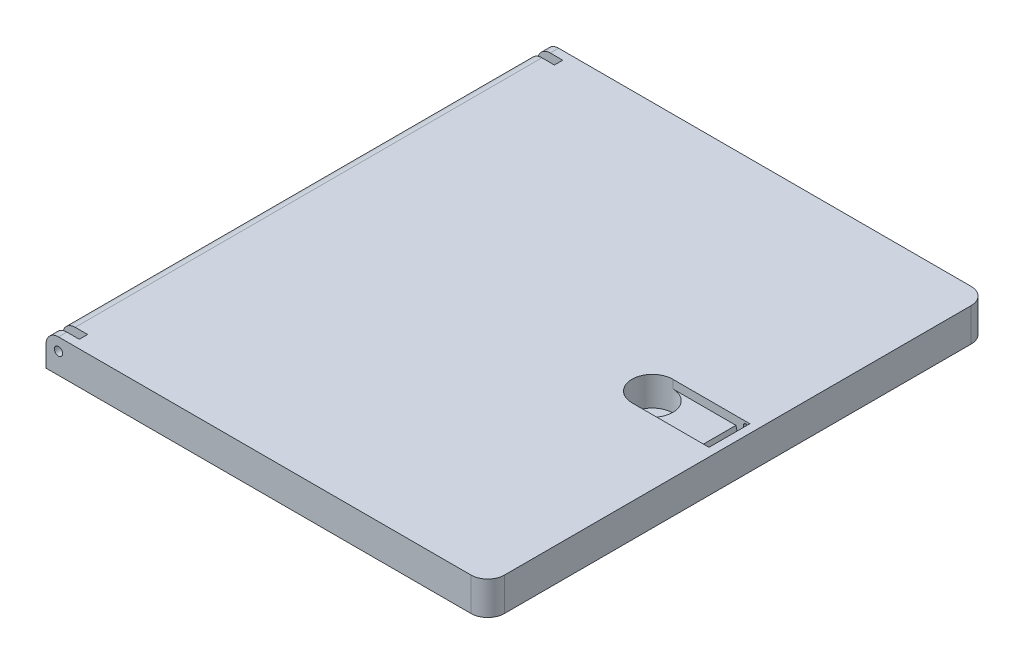
ISO-10303-21;
HEADER;
FILE_DESCRIPTION(('STEP AP214'),'2;1');
FILE_NAME('part.step','',(''),(''),'','','');
FILE_SCHEMA(('AUTOMOTIVE_DESIGN { 1 0 10303 214 1 1 1 1 }'));
ENDSEC;
DATA;
#1=APPLICATION_CONTEXT('core data for automotive mechanical design processes');
#2=APPLICATION_PROTOCOL_DEFINITION('international standard','automotive_design',2000,#1);
#3=PRODUCT_CONTEXT('',#1,'mechanical');
#4=PRODUCT('Part','Part','',(#3));
#5=PRODUCT_RELATED_PRODUCT_CATEGORY('part','',(#4));
#6=PRODUCT_DEFINITION_FORMATION('','',#4);
#7=PRODUCT_DEFINITION_CONTEXT('part definition',#1,'design');
#8=PRODUCT_DEFINITION('design','',#6,#7);
#9=PRODUCT_DEFINITION_SHAPE('','',#8);
#10=(LENGTH_UNIT() NAMED_UNIT(*) SI_UNIT(.MILLI.,.METRE.));
#11=(NAMED_UNIT(*) PLANE_ANGLE_UNIT() SI_UNIT($,.RADIAN.));
#12=(NAMED_UNIT(*) SI_UNIT($,.STERADIAN.) SOLID_ANGLE_UNIT());
#13=UNCERTAINTY_MEASURE_WITH_UNIT(LENGTH_MEASURE(1.E-05),#10,'distance_accuracy_value','');
#14=(GEOMETRIC_REPRESENTATION_CONTEXT(3) GLOBAL_UNCERTAINTY_ASSIGNED_CONTEXT((#13)) GLOBAL_UNIT_ASSIGNED_CONTEXT((#10,
#11,#12)) REPRESENTATION_CONTEXT('',''));
#15=CARTESIAN_POINT('',(0.,0.,0.));
#16=DIRECTION('',(0.,0.,1.));
#17=DIRECTION('',(1.,0.,0.));
#18=AXIS2_PLACEMENT_3D('',#15,#16,#17);
#19=CARTESIAN_POINT('',(-106.,-8.,0.));
#20=DIRECTION('',(-1.,0.,0.));
#21=DIRECTION('',(0.,0.,1.));
#22=AXIS2_PLACEMENT_3D('',#19,#20,#21);
#23=PLANE('',#22);
#24=DIRECTION('',(0.,1.,0.));
#25=VECTOR('',#24,1.);
#26=CARTESIAN_POINT('',(-106.,-8.,60.));
#27=LINE('',#26,#25);
#28=CARTESIAN_POINT('',(-106.,-8.,60.));
#29=VERTEX_POINT('',#28);
#30=CARTESIAN_POINT('',(-106.,-3.,60.));
#31=VERTEX_POINT('',#30);
#32=EDGE_CURVE('E267',#29,#31,#27,.T.);
#33=ORIENTED_EDGE('',*,*,#32,.T.);
#34=DIRECTION('',(0.,0.,1.));
#35=VECTOR('',#34,1.);
#36=CARTESIAN_POINT('',(-106.,-3.,-60.));
#37=LINE('',#36,#35);
#38=CARTESIAN_POINT('',(-106.,-3.,58.));
#39=VERTEX_POINT('',#38);
#40=EDGE_CURVE('E241',#39,#31,#37,.T.);
#41=ORIENTED_EDGE('',*,*,#40,.F.);
#42=DIRECTION('',(0.,1.,0.));
#43=VECTOR('',#42,1.);
#44=CARTESIAN_POINT('',(-106.,-6.,58.));
#45=LINE('',#44,#43);
#46=CARTESIAN_POINT('',(-106.,-6.,58.));
#47=VERTEX_POINT('',#46);
#48=EDGE_CURVE('E331',#47,#39,#45,.T.);
#49=ORIENTED_EDGE('',*,*,#48,.F.);
#50=DIRECTION('',(0.,0.,1.));
#51=VECTOR('',#50,1.);
#52=CARTESIAN_POINT('',(-106.,-6.,58.));
#53=LINE('',#52,#51);
#54=CARTESIAN_POINT('',(-106.,-6.,56.));
#55=VERTEX_POINT('',#54);
#56=EDGE_CURVE('E318',#55,#47,#53,.T.);
#57=ORIENTED_EDGE('',*,*,#56,.F.);
#58=DIRECTION('',(0.,1.,0.));
#59=VECTOR('',#58,1.);
#60=CARTESIAN_POINT('',(-106.,-6.,56.));
#61=LINE('',#60,#59);
#62=CARTESIAN_POINT('',(-106.,-3.,56.));
#63=VERTEX_POINT('',#62);
#64=EDGE_CURVE('E338',#55,#63,#61,.T.);
#65=ORIENTED_EDGE('',*,*,#64,.T.);
#66=CARTESIAN_POINT('',(-106.,-3.,-56.));
#67=VERTEX_POINT('',#66);
#68=EDGE_CURVE('E490',#67,#63,#37,.T.);
#69=ORIENTED_EDGE('',*,*,#68,.F.);
#70=DIRECTION('',(0.,1.,0.));
#71=VECTOR('',#70,1.);
#72=CARTESIAN_POINT('',(-106.,-6.,-56.));
#73=LINE('',#72,#71);
#74=CARTESIAN_POINT('',(-106.,-6.,-56.));
#75=VERTEX_POINT('',#74);
#76=EDGE_CURVE('E530',#75,#67,#73,.T.);
#77=ORIENTED_EDGE('',*,*,#76,.F.);
#78=DIRECTION('',(0.,0.,-1.));
#79=VECTOR('',#78,1.);
#80=CARTESIAN_POINT('',(-106.,-6.,-58.));
#81=LINE('',#80,#79);
#82=CARTESIAN_POINT('',(-106.,-6.,-58.));
#83=VERTEX_POINT('',#82);
#84=EDGE_CURVE('E522',#75,#83,#81,.T.);
#85=ORIENTED_EDGE('',*,*,#84,.T.);
#86=DIRECTION('',(0.,1.,0.));
#87=VECTOR('',#86,1.);
#88=CARTESIAN_POINT('',(-106.,-6.,-58.));
#89=LINE('',#88,#87);
#90=CARTESIAN_POINT('',(-106.,-3.,-58.));
#91=VERTEX_POINT('',#90);
#92=EDGE_CURVE('E302',#83,#91,#89,.T.);
#93=ORIENTED_EDGE('',*,*,#92,.T.);
#94=CARTESIAN_POINT('',(-106.,-3.,-60.));
#95=VERTEX_POINT('',#94);
#96=EDGE_CURVE('E56',#95,#91,#37,.T.);
#97=ORIENTED_EDGE('',*,*,#96,.F.);
#98=DIRECTION('',(0.,1.,0.));
#99=VECTOR('',#98,1.);
#100=CARTESIAN_POINT('',(-106.,-8.,-60.));
#101=LINE('',#100,#99);
#102=CARTESIAN_POINT('',(-106.,-8.,-60.));
#103=VERTEX_POINT('',#102);
#104=EDGE_CURVE('E252',#103,#95,#101,.T.);
#105=ORIENTED_EDGE('',*,*,#104,.F.);
#106=DIRECTION('',(0.,0.,1.));
#107=VECTOR('',#106,1.);
#108=CARTESIAN_POINT('',(-106.,-8.,0.));
#109=LINE('',#108,#107);
#110=EDGE_CURVE('E458',#103,#29,#109,.T.);
#111=ORIENTED_EDGE('',*,*,#110,.T.);
#112=EDGE_LOOP('',(#33,#41,#49,#57,#65,#69,#77,#85,#93,#97,#105,#111));
#113=FACE_BOUND('',#112,.T.);
#114=ADVANCED_FACE('F33',(#113),#23,.T.);
#115=CARTESIAN_POINT('',(0.,0.,0.));
#116=DIRECTION('',(0.,-1.,0.));
#117=DIRECTION('',(0.,0.,-1.));
#118=AXIS2_PLACEMENT_3D('',#115,#116,#117);
#119=PLANE('',#118);
#120=DIRECTION('',(0.,0.,-1.));
#121=VECTOR('',#120,1.);
#122=CARTESIAN_POINT('',(-2.,0.,0.));
#123=LINE('',#122,#121);
#124=CARTESIAN_POINT('',(-2.,0.,4.9));
#125=VERTEX_POINT('',#124);
#126=CARTESIAN_POINT('',(-2.,0.,-4.9));
#127=VERTEX_POINT('',#126);
#128=EDGE_CURVE('E428',#125,#127,#123,.T.);
#129=ORIENTED_EDGE('',*,*,#128,.F.);
#130=DIRECTION('',(1.,0.,0.));
#131=VECTOR('',#130,1.);
#132=CARTESIAN_POINT('',(-2.,0.,4.9));
#133=LINE('',#132,#131);
#134=CARTESIAN_POINT('',(-20.5,0.,4.9));
#135=VERTEX_POINT('',#134);
#136=EDGE_CURVE('E434',#135,#125,#133,.T.);
#137=ORIENTED_EDGE('',*,*,#136,.F.);
#138=CARTESIAN_POINT('',(-20.5,0.,0.));
#139=DIRECTION('',(0.,1.,0.));
#140=DIRECTION('',(0.,0.,1.));
#141=AXIS2_PLACEMENT_3D('',#138,#139,#140);
#142=CIRCLE('',#141,4.9);
#143=CARTESIAN_POINT('',(-20.5,0.,-4.9));
#144=VERTEX_POINT('',#143);
#145=EDGE_CURVE('E443',#144,#135,#142,.T.);
#146=ORIENTED_EDGE('',*,*,#145,.F.);
#147=DIRECTION('',(-1.,0.,0.));
#148=VECTOR('',#147,1.);
#149=CARTESIAN_POINT('',(-2.,0.,-4.9));
#150=LINE('',#149,#148);
#151=EDGE_CURVE('E440',#127,#144,#150,.T.);
#152=ORIENTED_EDGE('',*,*,#151,.F.);
#153=EDGE_LOOP('',(#129,#137,#146,#152));
#154=FACE_BOUND('',#153,.T.);
#155=DIRECTION('',(0.,0.,1.));
#156=VECTOR('',#155,1.);
#157=CARTESIAN_POINT('',(-103.,0.,-60.));
#158=LINE('',#157,#156);
#159=CARTESIAN_POINT('',(-103.,0.,58.));
#160=VERTEX_POINT('',#159);
#161=CARTESIAN_POINT('',(-103.,0.,60.));
#162=VERTEX_POINT('',#161);
#163=EDGE_CURVE('E48',#160,#162,#158,.T.);
#164=ORIENTED_EDGE('',*,*,#163,.T.);
#165=DIRECTION('',(1.,0.,0.));
#166=VECTOR('',#165,1.);
#167=CARTESIAN_POINT('',(0.,0.,60.));
#168=LINE('',#167,#166);
#169=CARTESIAN_POINT('',(-4.,0.,60.));
#170=VERTEX_POINT('',#169);
#171=EDGE_CURVE('E258',#162,#170,#168,.T.);
#172=ORIENTED_EDGE('',*,*,#171,.T.);
#173=CARTESIAN_POINT('',(-4.,0.,56.));
#174=DIRECTION('',(0.,-1.,0.));
#175=DIRECTION('',(0.,0.,-1.));
#176=AXIS2_PLACEMENT_3D('',#173,#174,#175);
#177=CIRCLE('',#176,4.);
#178=CARTESIAN_POINT('',(0.,0.,56.));
#179=VERTEX_POINT('',#178);
#180=EDGE_CURVE('E276',#170,#179,#177,.F.);
#181=ORIENTED_EDGE('',*,*,#180,.T.);
#182=DIRECTION('',(0.,0.,-1.));
#183=VECTOR('',#182,1.);
#184=CARTESIAN_POINT('',(0.,0.,0.));
#185=LINE('',#184,#183);
#186=CARTESIAN_POINT('',(0.,0.,-56.));
#187=VERTEX_POINT('',#186);
#188=EDGE_CURVE('E259',#179,#187,#185,.T.);
#189=ORIENTED_EDGE('',*,*,#188,.T.);
#190=CARTESIAN_POINT('',(-4.,0.,-56.));
#191=DIRECTION('',(0.,-1.,0.));
#192=DIRECTION('',(0.,0.,-1.));
#193=AXIS2_PLACEMENT_3D('',#190,#191,#192);
#194=CIRCLE('',#193,4.);
#195=CARTESIAN_POINT('',(-4.,0.,-60.));
#196=VERTEX_POINT('',#195);
#197=EDGE_CURVE('E257',#187,#196,#194,.F.);
#198=ORIENTED_EDGE('',*,*,#197,.T.);
#199=DIRECTION('',(-1.,0.,0.));
#200=VECTOR('',#199,1.);
#201=CARTESIAN_POINT('',(0.,0.,-60.));
#202=LINE('',#201,#200);
#203=CARTESIAN_POINT('',(-103.,0.,-60.));
#204=VERTEX_POINT('',#203);
#205=EDGE_CURVE('E249',#196,#204,#202,.T.);
#206=ORIENTED_EDGE('',*,*,#205,.T.);
#207=CARTESIAN_POINT('',(-103.,0.,-58.));
#208=VERTEX_POINT('',#207);
#209=EDGE_CURVE('E233',#204,#208,#158,.T.);
#210=ORIENTED_EDGE('',*,*,#209,.T.);
#211=DIRECTION('',(1.,0.,0.));
#212=VECTOR('',#211,1.);
#213=CARTESIAN_POINT('',(-106.,0.,-58.));
#214=LINE('',#213,#212);
#215=CARTESIAN_POINT('',(-100.,0.,-58.));
#216=VERTEX_POINT('',#215);
#217=EDGE_CURVE('E525',#208,#216,#214,.T.);
#218=ORIENTED_EDGE('',*,*,#217,.T.);
#219=DIRECTION('',(0.,0.,1.));
#220=VECTOR('',#219,1.);
#221=CARTESIAN_POINT('',(-100.,0.,-58.));
#222=LINE('',#221,#220);
#223=CARTESIAN_POINT('',(-100.,0.,-56.));
#224=VERTEX_POINT('',#223);
#225=EDGE_CURVE('E518',#216,#224,#222,.T.);
#226=ORIENTED_EDGE('',*,*,#225,.T.);
#227=DIRECTION('',(-1.,0.,0.));
#228=VECTOR('',#227,1.);
#229=CARTESIAN_POINT('',(-106.,0.,-56.));
#230=LINE('',#229,#228);
#231=CARTESIAN_POINT('',(-103.,0.,-56.));
#232=VERTEX_POINT('',#231);
#233=EDGE_CURVE('E515',#224,#232,#230,.T.);
#234=ORIENTED_EDGE('',*,*,#233,.T.);
#235=CARTESIAN_POINT('',(-103.,0.,56.));
#236=VERTEX_POINT('',#235);
#237=EDGE_CURVE('E242',#232,#236,#158,.T.);
#238=ORIENTED_EDGE('',*,*,#237,.T.);
#239=DIRECTION('',(-1.,0.,0.));
#240=VECTOR('',#239,1.);
#241=CARTESIAN_POINT('',(-106.,0.,56.));
#242=LINE('',#241,#240);
#243=CARTESIAN_POINT('',(-100.,0.,56.));
#244=VERTEX_POINT('',#243);
#245=EDGE_CURVE('E322',#244,#236,#242,.T.);
#246=ORIENTED_EDGE('',*,*,#245,.F.);
#247=DIRECTION('',(0.,0.,-1.));
#248=VECTOR('',#247,1.);
#249=CARTESIAN_POINT('',(-100.,0.,58.));
#250=LINE('',#249,#248);
#251=CARTESIAN_POINT('',(-100.,0.,58.));
#252=VERTEX_POINT('',#251);
#253=EDGE_CURVE('E333',#252,#244,#250,.T.);
#254=ORIENTED_EDGE('',*,*,#253,.F.);
#255=DIRECTION('',(1.,0.,0.));
#256=VECTOR('',#255,1.);
#257=CARTESIAN_POINT('',(-106.,0.,58.));
#258=LINE('',#257,#256);
#259=EDGE_CURVE('E317',#160,#252,#258,.T.);
#260=ORIENTED_EDGE('',*,*,#259,.F.);
#261=EDGE_LOOP('',(#164,#172,#181,#189,#198,#206,#210,#218,#226,#234,#238,#246,#254,#260));
#262=FACE_BOUND('',#261,.T.);
#263=ADVANCED_FACE('F255',(#154,#262),#119,.F.);
#264=CARTESIAN_POINT('',(-103.,-3.,-60.));
#265=DIRECTION('',(0.,0.,1.));
#266=DIRECTION('',(1.,0.,0.));
#267=AXIS2_PLACEMENT_3D('',#264,#265,#266);
#268=CYLINDRICAL_SURFACE('',#267,0.999999999999998);
#269=CARTESIAN_POINT('',(-103.,-3.,-60.));
#270=DIRECTION('',(0.,0.,1.));
#271=DIRECTION('',(1.,0.,0.));
#272=AXIS2_PLACEMENT_3D('',#269,#270,#271);
#273=CIRCLE('',#272,0.999999999999998);
#274=CARTESIAN_POINT('',(-102.,-3.,-60.));
#275=VERTEX_POINT('',#274);
#276=EDGE_CURVE('E298',#275,#275,#273,.T.);
#277=ORIENTED_EDGE('',*,*,#276,.F.);
#278=EDGE_LOOP('',(#277));
#279=FACE_BOUND('',#278,.T.);
#280=CARTESIAN_POINT('',(-103.,-3.,-58.));
#281=DIRECTION('',(0.,0.,1.));
#282=DIRECTION('',(1.,0.,0.));
#283=AXIS2_PLACEMENT_3D('',#280,#281,#282);
#284=CIRCLE('',#283,0.999999999999998);
#285=CARTESIAN_POINT('',(-102.,-3.,-58.));
#286=VERTEX_POINT('',#285);
#287=EDGE_CURVE('E301',#286,#286,#284,.F.);
#288=ORIENTED_EDGE('',*,*,#287,.F.);
#289=EDGE_LOOP('',(#288));
#290=FACE_BOUND('',#289,.T.);
#291=ADVANCED_FACE('F572',(#279,#290),#268,.F.);
#292=CARTESIAN_POINT('',(-103.,-3.,56.));
#293=DIRECTION('',(0.,0.,-1.));
#294=DIRECTION('',(-1.,0.,0.));
#295=AXIS2_PLACEMENT_3D('',#292,#293,#294);
#296=CIRCLE('',#295,0.999999999999998);
#297=CARTESIAN_POINT('',(-104.,-3.,56.));
#298=VERTEX_POINT('',#297);
#299=EDGE_CURVE('E297',#298,#298,#296,.T.);
#300=ORIENTED_EDGE('',*,*,#299,.F.);
#301=EDGE_LOOP('',(#300));
#302=FACE_BOUND('',#301,.T.);
#303=CARTESIAN_POINT('',(-103.,-3.,-56.));
#304=DIRECTION('',(0.,0.,-1.));
#305=DIRECTION('',(-1.,0.,0.));
#306=AXIS2_PLACEMENT_3D('',#303,#304,#305);
#307=CIRCLE('',#306,0.999999999999998);
#308=CARTESIAN_POINT('',(-104.,-3.,-56.));
#309=VERTEX_POINT('',#308);
#310=EDGE_CURVE('E299',#309,#309,#307,.F.);
#311=ORIENTED_EDGE('',*,*,#310,.F.);
#312=EDGE_LOOP('',(#311));
#313=FACE_BOUND('',#312,.T.);
#314=ADVANCED_FACE('F816',(#302,#313),#268,.F.);
#315=CARTESIAN_POINT('',(0.,-8.,60.));
#316=DIRECTION('',(0.,0.,1.));
#317=DIRECTION('',(1.,0.,0.));
#318=AXIS2_PLACEMENT_3D('',#315,#316,#317);
#319=PLANE('',#318);
#320=CARTESIAN_POINT('',(-103.,-3.,60.));
#321=DIRECTION('',(0.,0.,-1.));
#322=DIRECTION('',(1.,0.,0.));
#323=AXIS2_PLACEMENT_3D('',#320,#321,#322);
#324=CIRCLE('',#323,2.99999999999999);
#325=EDGE_CURVE('E253',#31,#162,#324,.T.);
#326=ORIENTED_EDGE('',*,*,#325,.F.);
#327=ORIENTED_EDGE('',*,*,#32,.F.);
#328=DIRECTION('',(1.,0.,0.));
#329=VECTOR('',#328,1.);
#330=CARTESIAN_POINT('',(0.,-8.,60.));
#331=LINE('',#330,#329);
#332=CARTESIAN_POINT('',(-4.,-8.,60.));
#333=VERTEX_POINT('',#332);
#334=EDGE_CURVE('E272',#29,#333,#331,.T.);
#335=ORIENTED_EDGE('',*,*,#334,.T.);
#336=DIRECTION('',(0.,1.,0.));
#337=VECTOR('',#336,1.);
#338=CARTESIAN_POINT('',(-4.,-8.,60.));
#339=LINE('',#338,#337);
#340=EDGE_CURVE('E270',#333,#170,#339,.T.);
#341=ORIENTED_EDGE('',*,*,#340,.T.);
#342=ORIENTED_EDGE('',*,*,#171,.F.);
#343=EDGE_LOOP('',(#326,#327,#335,#341,#342));
#344=FACE_BOUND('',#343,.T.);
#345=CARTESIAN_POINT('',(-103.,-3.,60.));
#346=DIRECTION('',(0.,0.,1.));
#347=DIRECTION('',(1.,0.,0.));
#348=AXIS2_PLACEMENT_3D('',#345,#346,#347);
#349=CIRCLE('',#348,0.999999999999998);
#350=CARTESIAN_POINT('',(-102.,-3.,60.));
#351=VERTEX_POINT('',#350);
#352=EDGE_CURVE('E304',#351,#351,#349,.T.);
#353=ORIENTED_EDGE('',*,*,#352,.F.);
#354=EDGE_LOOP('',(#353));
#355=FACE_BOUND('',#354,.T.);
#356=ADVANCED_FACE('F465',(#344,#355),#319,.T.);
#357=CARTESIAN_POINT('',(0.,-8.,-60.));
#358=DIRECTION('',(0.,0.,-1.));
#359=DIRECTION('',(-1.,0.,0.));
#360=AXIS2_PLACEMENT_3D('',#357,#358,#359);
#361=PLANE('',#360);
#362=CARTESIAN_POINT('',(-103.,-3.,-60.));
#363=DIRECTION('',(0.,0.,-1.));
#364=DIRECTION('',(1.,0.,0.));
#365=AXIS2_PLACEMENT_3D('',#362,#363,#364);
#366=CIRCLE('',#365,2.99999999999999);
#367=EDGE_CURVE('E236',#95,#204,#366,.T.);
#368=ORIENTED_EDGE('',*,*,#367,.T.);
#369=ORIENTED_EDGE('',*,*,#205,.F.);
#370=DIRECTION('',(0.,1.,0.));
#371=VECTOR('',#370,1.);
#372=CARTESIAN_POINT('',(-4.,-8.,-60.));
#373=LINE('',#372,#371);
#374=CARTESIAN_POINT('',(-4.,-8.,-60.));
#375=VERTEX_POINT('',#374);
#376=EDGE_CURVE('E287',#196,#375,#373,.F.);
#377=ORIENTED_EDGE('',*,*,#376,.T.);
#378=DIRECTION('',(-1.,0.,0.));
#379=VECTOR('',#378,1.);
#380=CARTESIAN_POINT('',(0.,-8.,-60.));
#381=LINE('',#380,#379);
#382=EDGE_CURVE('E456',#375,#103,#381,.T.);
#383=ORIENTED_EDGE('',*,*,#382,.T.);
#384=ORIENTED_EDGE('',*,*,#104,.T.);
#385=EDGE_LOOP('',(#368,#369,#377,#383,#384));
#386=FACE_BOUND('',#385,.T.);
#387=ORIENTED_EDGE('',*,*,#276,.T.);
#388=EDGE_LOOP('',(#387));
#389=FACE_BOUND('',#388,.T.);
#390=ADVANCED_FACE('F247',(#386,#389),#361,.T.);
#391=CARTESIAN_POINT('',(0.,-8.,0.));
#392=DIRECTION('',(1.,0.,0.));
#393=DIRECTION('',(0.,0.,-1.));
#394=AXIS2_PLACEMENT_3D('',#391,#392,#393);
#395=PLANE('',#394);
#396=ORIENTED_EDGE('',*,*,#188,.F.);
#397=DIRECTION('',(0.,1.,0.));
#398=VECTOR('',#397,1.);
#399=CARTESIAN_POINT('',(0.,-8.,56.));
#400=LINE('',#399,#398);
#401=CARTESIAN_POINT('',(0.,-8.,56.));
#402=VERTEX_POINT('',#401);
#403=EDGE_CURVE('E281',#179,#402,#400,.F.);
#404=ORIENTED_EDGE('',*,*,#403,.T.);
#405=DIRECTION('',(0.,0.,-1.));
#406=VECTOR('',#405,1.);
#407=CARTESIAN_POINT('',(0.,-8.,0.));
#408=LINE('',#407,#406);
#409=CARTESIAN_POINT('',(0.,-8.,-56.));
#410=VERTEX_POINT('',#409);
#411=EDGE_CURVE('E261',#402,#410,#408,.T.);
#412=ORIENTED_EDGE('',*,*,#411,.T.);
#413=DIRECTION('',(0.,1.,0.));
#414=VECTOR('',#413,1.);
#415=CARTESIAN_POINT('',(0.,-8.,-56.));
#416=LINE('',#415,#414);
#417=EDGE_CURVE('E278',#410,#187,#416,.T.);
#418=ORIENTED_EDGE('',*,*,#417,.T.);
#419=EDGE_LOOP('',(#396,#404,#412,#418));
#420=FACE_BOUND('',#419,.T.);
#421=ADVANCED_FACE('F477',(#420),#395,.T.);
#422=CARTESIAN_POINT('',(0.,-8.,0.));
#423=DIRECTION('',(0.,-1.,0.));
#424=DIRECTION('',(0.,0.,-1.));
#425=AXIS2_PLACEMENT_3D('',#422,#423,#424);
#426=PLANE('',#425);
#427=ORIENTED_EDGE('',*,*,#411,.F.);
#428=CARTESIAN_POINT('',(-4.,-8.,56.));
#429=DIRECTION('',(0.,-1.,0.));
#430=DIRECTION('',(0.,0.,-1.));
#431=AXIS2_PLACEMENT_3D('',#428,#429,#430);
#432=CIRCLE('',#431,4.);
#433=EDGE_CURVE('E285',#402,#333,#432,.T.);
#434=ORIENTED_EDGE('',*,*,#433,.T.);
#435=ORIENTED_EDGE('',*,*,#334,.F.);
#436=ORIENTED_EDGE('',*,*,#110,.F.);
#437=ORIENTED_EDGE('',*,*,#382,.F.);
#438=CARTESIAN_POINT('',(-4.,-8.,-56.));
#439=DIRECTION('',(0.,-1.,0.));
#440=DIRECTION('',(0.,0.,-1.));
#441=AXIS2_PLACEMENT_3D('',#438,#439,#440);
#442=CIRCLE('',#441,4.);
#443=EDGE_CURVE('E283',#375,#410,#442,.T.);
#444=ORIENTED_EDGE('',*,*,#443,.T.);
#445=EDGE_LOOP('',(#427,#434,#435,#436,#437,#444));
#446=FACE_BOUND('',#445,.T.);
#447=ADVANCED_FACE('F484',(#446),#426,.T.);
#448=CARTESIAN_POINT('',(-4.,-8.,56.));
#449=DIRECTION('',(0.,1.,0.));
#450=DIRECTION('',(0.,0.,1.));
#451=AXIS2_PLACEMENT_3D('',#448,#449,#450);
#452=CYLINDRICAL_SURFACE('',#451,4.);
#453=ORIENTED_EDGE('',*,*,#433,.F.);
#454=ORIENTED_EDGE('',*,*,#403,.F.);
#455=ORIENTED_EDGE('',*,*,#180,.F.);
#456=ORIENTED_EDGE('',*,*,#340,.F.);
#457=EDGE_LOOP('',(#453,#454,#455,#456));
#458=FACE_BOUND('',#457,.T.);
#459=ADVANCED_FACE('F473',(#458),#452,.T.);
#460=CARTESIAN_POINT('',(-4.,-8.,-56.));
#461=DIRECTION('',(0.,1.,0.));
#462=DIRECTION('',(0.,0.,1.));
#463=AXIS2_PLACEMENT_3D('',#460,#461,#462);
#464=CYLINDRICAL_SURFACE('',#463,4.);
#465=ORIENTED_EDGE('',*,*,#443,.F.);
#466=ORIENTED_EDGE('',*,*,#376,.F.);
#467=ORIENTED_EDGE('',*,*,#197,.F.);
#468=ORIENTED_EDGE('',*,*,#417,.F.);
#469=EDGE_LOOP('',(#465,#466,#467,#468));
#470=FACE_BOUND('',#469,.T.);
#471=ADVANCED_FACE('F482',(#470),#464,.T.);
#472=CARTESIAN_POINT('',(-2.,-2.,4.9));
#473=DIRECTION('',(0.,0.,1.));
#474=DIRECTION('',(1.,0.,0.));
#475=AXIS2_PLACEMENT_3D('',#472,#473,#474);
#476=PLANE('',#475);
#477=DIRECTION('',(0.,-1.,0.));
#478=VECTOR('',#477,1.);
#479=CARTESIAN_POINT('',(-2.5,-1.,4.9));
#480=LINE('',#479,#478);
#481=CARTESIAN_POINT('',(-2.5,-1.,4.9));
#482=VERTEX_POINT('',#481);
#483=CARTESIAN_POINT('',(-2.5,-6.,4.9));
#484=VERTEX_POINT('',#483);
#485=EDGE_CURVE('E364',#482,#484,#480,.T.);
#486=ORIENTED_EDGE('',*,*,#485,.F.);
#487=CARTESIAN_POINT('',(-3.,-1.,4.9));
#488=DIRECTION('',(0.,0.,-1.));
#489=DIRECTION('',(-1.,0.,0.));
#490=AXIS2_PLACEMENT_3D('',#487,#488,#489);
#491=CIRCLE('',#490,0.5);
#492=CARTESIAN_POINT('',(-3.5,-1.,4.9));
#493=VERTEX_POINT('',#492);
#494=EDGE_CURVE('E341',#493,#482,#491,.T.);
#495=ORIENTED_EDGE('',*,*,#494,.F.);
#496=DIRECTION('',(0.,1.,0.));
#497=VECTOR('',#496,1.);
#498=CARTESIAN_POINT('',(-3.5,-1.,4.9));
#499=LINE('',#498,#497);
#500=CARTESIAN_POINT('',(-3.5,-6.,4.9));
#501=VERTEX_POINT('',#500);
#502=EDGE_CURVE('E353',#501,#493,#499,.T.);
#503=ORIENTED_EDGE('',*,*,#502,.F.);
#504=CARTESIAN_POINT('',(-3.,-6.,4.9));
#505=DIRECTION('',(0.,0.,-1.));
#506=DIRECTION('',(-1.,0.,0.));
#507=AXIS2_PLACEMENT_3D('',#504,#505,#506);
#508=CIRCLE('',#507,0.5);
#509=EDGE_CURVE('E367',#484,#501,#508,.T.);
#510=ORIENTED_EDGE('',*,*,#509,.F.);
#511=EDGE_LOOP('',(#486,#495,#503,#510));
#512=FACE_BOUND('',#511,.T.);
#513=ORIENTED_EDGE('',*,*,#136,.T.);
#514=DIRECTION('',(0.,1.,0.));
#515=VECTOR('',#514,1.);
#516=CARTESIAN_POINT('',(-2.,-2.,4.9));
#517=LINE('',#516,#515);
#518=CARTESIAN_POINT('',(-2.,-7.,4.9));
#519=VERTEX_POINT('',#518);
#520=EDGE_CURVE('E263',#519,#125,#517,.T.);
#521=ORIENTED_EDGE('',*,*,#520,.F.);
#522=DIRECTION('',(1.,0.,0.));
#523=VECTOR('',#522,1.);
#524=CARTESIAN_POINT('',(-2.,-7.,4.9));
#525=LINE('',#524,#523);
#526=CARTESIAN_POINT('',(-4.,-7.,4.9));
#527=VERTEX_POINT('',#526);
#528=EDGE_CURVE('E421',#527,#519,#525,.T.);
#529=ORIENTED_EDGE('',*,*,#528,.F.);
#530=DIRECTION('',(-0.258819045102518,0.965925826289069,0.));
#531=VECTOR('',#530,1.);
#532=CARTESIAN_POINT('',(-5.11602540378444,-2.83493649053889,4.9));
#533=LINE('',#532,#531);
#534=CARTESIAN_POINT('',(-5.33974596215561,-2.,4.9));
#535=VERTEX_POINT('',#534);
#536=EDGE_CURVE('E291',#527,#535,#533,.T.);
#537=ORIENTED_EDGE('',*,*,#536,.T.);
#538=DIRECTION('',(1.,0.,0.));
#539=VECTOR('',#538,1.);
#540=CARTESIAN_POINT('',(-2.,-2.,4.9));
#541=LINE('',#540,#539);
#542=CARTESIAN_POINT('',(-20.5,-2.,4.9));
#543=VERTEX_POINT('',#542);
#544=EDGE_CURVE('E433',#543,#535,#541,.T.);
#545=ORIENTED_EDGE('',*,*,#544,.F.);
#546=DIRECTION('',(0.,1.,0.));
#547=VECTOR('',#546,1.);
#548=CARTESIAN_POINT('',(-20.5,-2.,4.9));
#549=LINE('',#548,#547);
#550=EDGE_CURVE('E449',#543,#135,#549,.T.);
#551=ORIENTED_EDGE('',*,*,#550,.T.);
#552=EDGE_LOOP('',(#513,#521,#529,#537,#545,#551));
#553=FACE_BOUND('',#552,.T.);
#554=ADVANCED_FACE('F583',(#512,#553),#476,.F.);
#555=CARTESIAN_POINT('',(-20.5,-2.,0.));
#556=DIRECTION('',(0.,1.,0.));
#557=DIRECTION('',(0.,0.,1.));
#558=AXIS2_PLACEMENT_3D('',#555,#556,#557);
#559=CYLINDRICAL_SURFACE('',#558,4.9);
#560=ORIENTED_EDGE('',*,*,#145,.T.);
#561=ORIENTED_EDGE('',*,*,#550,.F.);
#562=CARTESIAN_POINT('',(-20.5,-2.,0.));
#563=DIRECTION('',(0.,1.,0.));
#564=DIRECTION('',(0.,0.,1.));
#565=AXIS2_PLACEMENT_3D('',#562,#563,#564);
#566=CIRCLE('',#565,4.9);
#567=CARTESIAN_POINT('',(-20.5,-2.,-4.9));
#568=VERTEX_POINT('',#567);
#569=EDGE_CURVE('E424',#543,#568,#566,.T.);
#570=ORIENTED_EDGE('',*,*,#569,.T.);
#571=DIRECTION('',(0.,1.,0.));
#572=VECTOR('',#571,1.);
#573=CARTESIAN_POINT('',(-20.5,-2.,-4.9));
#574=LINE('',#573,#572);
#575=EDGE_CURVE('E451',#568,#144,#574,.T.);
#576=ORIENTED_EDGE('',*,*,#575,.T.);
#577=EDGE_LOOP('',(#560,#561,#570,#576));
#578=FACE_BOUND('',#577,.T.);
#579=CARTESIAN_POINT('',(-20.5,-7.,0.));
#580=DIRECTION('',(0.,1.,0.));
#581=DIRECTION('',(0.,0.,1.));
#582=AXIS2_PLACEMENT_3D('',#579,#580,#581);
#583=CIRCLE('',#582,4.9);
#584=CARTESIAN_POINT('',(-20.5,-7.,4.9));
#585=VERTEX_POINT('',#584);
#586=EDGE_CURVE('E425',#585,#585,#583,.T.);
#587=ORIENTED_EDGE('',*,*,#586,.F.);
#588=EDGE_LOOP('',(#587));
#589=FACE_BOUND('',#588,.T.);
#590=ADVANCED_FACE('F587',(#578,#589),#559,.F.);
#591=CARTESIAN_POINT('',(-2.,-2.,-4.9));
#592=DIRECTION('',(0.,0.,-1.));
#593=DIRECTION('',(-1.,0.,0.));
#594=AXIS2_PLACEMENT_3D('',#591,#592,#593);
#595=PLANE('',#594);
#596=DIRECTION('',(0.,-1.,0.));
#597=VECTOR('',#596,1.);
#598=CARTESIAN_POINT('',(-3.5,-1.,-4.9));
#599=LINE('',#598,#597);
#600=CARTESIAN_POINT('',(-3.5,-1.,-4.9));
#601=VERTEX_POINT('',#600);
#602=CARTESIAN_POINT('',(-3.5,-6.,-4.9));
#603=VERTEX_POINT('',#602);
#604=EDGE_CURVE('E396',#601,#603,#599,.T.);
#605=ORIENTED_EDGE('',*,*,#604,.F.);
#606=CARTESIAN_POINT('',(-3.,-1.,-4.9));
#607=DIRECTION('',(0.,0.,1.));
#608=DIRECTION('',(1.,0.,0.));
#609=AXIS2_PLACEMENT_3D('',#606,#607,#608);
#610=CIRCLE('',#609,0.5);
#611=CARTESIAN_POINT('',(-2.5,-1.,-4.9));
#612=VERTEX_POINT('',#611);
#613=EDGE_CURVE('E374',#612,#601,#610,.T.);
#614=ORIENTED_EDGE('',*,*,#613,.F.);
#615=DIRECTION('',(0.,1.,0.));
#616=VECTOR('',#615,1.);
#617=CARTESIAN_POINT('',(-2.5,-6.,-4.9));
#618=LINE('',#617,#616);
#619=CARTESIAN_POINT('',(-2.5,-6.,-4.9));
#620=VERTEX_POINT('',#619);
#621=EDGE_CURVE('E385',#620,#612,#618,.T.);
#622=ORIENTED_EDGE('',*,*,#621,.F.);
#623=CARTESIAN_POINT('',(-3.,-6.,-4.9));
#624=DIRECTION('',(0.,0.,1.));
#625=DIRECTION('',(1.,0.,0.));
#626=AXIS2_PLACEMENT_3D('',#623,#624,#625);
#627=CIRCLE('',#626,0.5);
#628=EDGE_CURVE('E399',#603,#620,#627,.T.);
#629=ORIENTED_EDGE('',*,*,#628,.F.);
#630=EDGE_LOOP('',(#605,#614,#622,#629));
#631=FACE_BOUND('',#630,.T.);
#632=ORIENTED_EDGE('',*,*,#151,.T.);
#633=ORIENTED_EDGE('',*,*,#575,.F.);
#634=DIRECTION('',(-1.,0.,0.));
#635=VECTOR('',#634,1.);
#636=CARTESIAN_POINT('',(-2.,-2.,-4.9));
#637=LINE('',#636,#635);
#638=CARTESIAN_POINT('',(-5.33974596215561,-2.,-4.9));
#639=VERTEX_POINT('',#638);
#640=EDGE_CURVE('E431',#639,#568,#637,.T.);
#641=ORIENTED_EDGE('',*,*,#640,.F.);
#642=DIRECTION('',(0.258819045102518,-0.965925826289069,0.));
#643=VECTOR('',#642,1.);
#644=CARTESIAN_POINT('',(-5.11602540378444,-2.83493649053889,-4.9));
#645=LINE('',#644,#643);
#646=CARTESIAN_POINT('',(-4.,-7.,-4.9));
#647=VERTEX_POINT('',#646);
#648=EDGE_CURVE('E41',#639,#647,#645,.T.);
#649=ORIENTED_EDGE('',*,*,#648,.T.);
#650=DIRECTION('',(-1.,0.,0.));
#651=VECTOR('',#650,1.);
#652=CARTESIAN_POINT('',(-2.,-7.,-4.9));
#653=LINE('',#652,#651);
#654=CARTESIAN_POINT('',(-2.,-7.,-4.9));
#655=VERTEX_POINT('',#654);
#656=EDGE_CURVE('E415',#655,#647,#653,.T.);
#657=ORIENTED_EDGE('',*,*,#656,.F.);
#658=DIRECTION('',(0.,1.,0.));
#659=VECTOR('',#658,1.);
#660=CARTESIAN_POINT('',(-2.,-2.,-4.9));
#661=LINE('',#660,#659);
#662=EDGE_CURVE('E437',#655,#127,#661,.T.);
#663=ORIENTED_EDGE('',*,*,#662,.T.);
#664=EDGE_LOOP('',(#632,#633,#641,#649,#657,#663));
#665=FACE_BOUND('',#664,.T.);
#666=ADVANCED_FACE('F593',(#631,#665),#595,.F.);
#667=CARTESIAN_POINT('',(-2.,-2.,0.));
#668=DIRECTION('',(1.,0.,0.));
#669=DIRECTION('',(0.,0.,-1.));
#670=AXIS2_PLACEMENT_3D('',#667,#668,#669);
#671=PLANE('',#670);
#672=ORIENTED_EDGE('',*,*,#128,.T.);
#673=ORIENTED_EDGE('',*,*,#662,.F.);
#674=DIRECTION('',(0.,0.,-1.));
#675=VECTOR('',#674,1.);
#676=CARTESIAN_POINT('',(-2.,-7.,-4.9));
#677=LINE('',#676,#675);
#678=EDGE_CURVE('E406',#519,#655,#677,.T.);
#679=ORIENTED_EDGE('',*,*,#678,.F.);
#680=ORIENTED_EDGE('',*,*,#520,.T.);
#681=EDGE_LOOP('',(#672,#673,#679,#680));
#682=FACE_BOUND('',#681,.T.);
#683=ADVANCED_FACE('F604',(#682),#671,.F.);
#684=CARTESIAN_POINT('',(-20.5,-2.,0.));
#685=DIRECTION('',(0.,1.,0.));
#686=DIRECTION('',(0.,0.,1.));
#687=AXIS2_PLACEMENT_3D('',#684,#685,#686);
#688=PLANE('',#687);
#689=ORIENTED_EDGE('',*,*,#544,.T.);
#690=DIRECTION('',(0.,0.,-1.));
#691=VECTOR('',#690,1.);
#692=CARTESIAN_POINT('',(-5.33974596215561,-2.,-4.9));
#693=LINE('',#692,#691);
#694=EDGE_CURVE('E289',#535,#639,#693,.T.);
#695=ORIENTED_EDGE('',*,*,#694,.T.);
#696=ORIENTED_EDGE('',*,*,#640,.T.);
#697=ORIENTED_EDGE('',*,*,#569,.F.);
#698=EDGE_LOOP('',(#689,#695,#696,#697));
#699=FACE_BOUND('',#698,.T.);
#700=ADVANCED_FACE('F599',(#699),#688,.T.);
#701=CARTESIAN_POINT('',(-20.5,-7.,0.));
#702=DIRECTION('',(0.,1.,0.));
#703=DIRECTION('',(0.,0.,1.));
#704=AXIS2_PLACEMENT_3D('',#701,#702,#703);
#705=PLANE('',#704);
#706=ORIENTED_EDGE('',*,*,#586,.T.);
#707=EDGE_LOOP('',(#706));
#708=FACE_BOUND('',#707,.T.);
#709=ADVANCED_FACE('F646',(#708),#705,.T.);
#710=CARTESIAN_POINT('',(0.,-7.,0.));
#711=DIRECTION('',(0.,-1.,0.));
#712=DIRECTION('',(0.,0.,-1.));
#713=AXIS2_PLACEMENT_3D('',#710,#711,#712);
#714=PLANE('',#713);
#715=ORIENTED_EDGE('',*,*,#678,.T.);
#716=ORIENTED_EDGE('',*,*,#656,.T.);
#717=DIRECTION('',(0.,0.,1.));
#718=VECTOR('',#717,1.);
#719=CARTESIAN_POINT('',(-4.,-7.,-4.9));
#720=LINE('',#719,#718);
#721=EDGE_CURVE('E418',#647,#527,#720,.T.);
#722=ORIENTED_EDGE('',*,*,#721,.T.);
#723=ORIENTED_EDGE('',*,*,#528,.T.);
#724=EDGE_LOOP('',(#715,#716,#722,#723));
#725=FACE_BOUND('',#724,.T.);
#726=ADVANCED_FACE('F650',(#725),#714,.F.);
#727=CARTESIAN_POINT('',(-3.,-1.,-6.9));
#728=DIRECTION('',(0.,0.,1.));
#729=DIRECTION('',(1.,0.,0.));
#730=AXIS2_PLACEMENT_3D('',#727,#728,#729);
#731=CYLINDRICAL_SURFACE('',#730,0.5);
#732=ORIENTED_EDGE('',*,*,#613,.T.);
#733=DIRECTION('',(0.,0.,1.));
#734=VECTOR('',#733,1.);
#735=CARTESIAN_POINT('',(-3.5,-1.,-6.9));
#736=LINE('',#735,#734);
#737=CARTESIAN_POINT('',(-3.5,-1.,-6.9));
#738=VERTEX_POINT('',#737);
#739=EDGE_CURVE('E394',#738,#601,#736,.T.);
#740=ORIENTED_EDGE('',*,*,#739,.F.);
#741=CARTESIAN_POINT('',(-3.,-1.,-6.9));
#742=DIRECTION('',(0.,0.,1.));
#743=DIRECTION('',(1.,0.,0.));
#744=AXIS2_PLACEMENT_3D('',#741,#742,#743);
#745=CIRCLE('',#744,0.5);
#746=CARTESIAN_POINT('',(-2.5,-1.,-6.9));
#747=VERTEX_POINT('',#746);
#748=EDGE_CURVE('E381',#747,#738,#745,.T.);
#749=ORIENTED_EDGE('',*,*,#748,.F.);
#750=DIRECTION('',(0.,0.,1.));
#751=VECTOR('',#750,1.);
#752=CARTESIAN_POINT('',(-2.5,-1.,-6.9));
#753=LINE('',#752,#751);
#754=EDGE_CURVE('E404',#747,#612,#753,.T.);
#755=ORIENTED_EDGE('',*,*,#754,.T.);
#756=EDGE_LOOP('',(#732,#740,#749,#755));
#757=FACE_BOUND('',#756,.T.);
#758=ADVANCED_FACE('F657',(#757),#731,.F.);
#759=CARTESIAN_POINT('',(-2.5,-6.,-6.9));
#760=DIRECTION('',(1.,0.,0.));
#761=DIRECTION('',(0.,0.,-1.));
#762=AXIS2_PLACEMENT_3D('',#759,#760,#761);
#763=PLANE('',#762);
#764=ORIENTED_EDGE('',*,*,#621,.T.);
#765=ORIENTED_EDGE('',*,*,#754,.F.);
#766=DIRECTION('',(0.,1.,0.));
#767=VECTOR('',#766,1.);
#768=CARTESIAN_POINT('',(-2.5,-6.,-6.9));
#769=LINE('',#768,#767);
#770=CARTESIAN_POINT('',(-2.5,-6.,-6.9));
#771=VERTEX_POINT('',#770);
#772=EDGE_CURVE('E391',#771,#747,#769,.T.);
#773=ORIENTED_EDGE('',*,*,#772,.F.);
#774=DIRECTION('',(0.,0.,1.));
#775=VECTOR('',#774,1.);
#776=CARTESIAN_POINT('',(-2.5,-6.,-6.9));
#777=LINE('',#776,#775);
#778=EDGE_CURVE('E407',#771,#620,#777,.T.);
#779=ORIENTED_EDGE('',*,*,#778,.T.);
#780=EDGE_LOOP('',(#764,#765,#773,#779));
#781=FACE_BOUND('',#780,.T.);
#782=ADVANCED_FACE('F662',(#781),#763,.F.);
#783=CARTESIAN_POINT('',(-3.,-6.,-6.9));
#784=DIRECTION('',(0.,0.,1.));
#785=DIRECTION('',(1.,0.,0.));
#786=AXIS2_PLACEMENT_3D('',#783,#784,#785);
#787=CYLINDRICAL_SURFACE('',#786,0.5);
#788=ORIENTED_EDGE('',*,*,#628,.T.);
#789=ORIENTED_EDGE('',*,*,#778,.F.);
#790=CARTESIAN_POINT('',(-3.,-6.,-6.9));
#791=DIRECTION('',(0.,0.,1.));
#792=DIRECTION('',(1.,0.,0.));
#793=AXIS2_PLACEMENT_3D('',#790,#791,#792);
#794=CIRCLE('',#793,0.5);
#795=CARTESIAN_POINT('',(-3.5,-6.,-6.9));
#796=VERTEX_POINT('',#795);
#797=EDGE_CURVE('E388',#796,#771,#794,.T.);
#798=ORIENTED_EDGE('',*,*,#797,.F.);
#799=DIRECTION('',(0.,0.,1.));
#800=VECTOR('',#799,1.);
#801=CARTESIAN_POINT('',(-3.5,-6.,-6.9));
#802=LINE('',#801,#800);
#803=EDGE_CURVE('E409',#796,#603,#802,.T.);
#804=ORIENTED_EDGE('',*,*,#803,.T.);
#805=EDGE_LOOP('',(#788,#789,#798,#804));
#806=FACE_BOUND('',#805,.T.);
#807=ADVANCED_FACE('F672',(#806),#787,.F.);
#808=CARTESIAN_POINT('',(-3.5,-1.,-6.9));
#809=DIRECTION('',(-1.,0.,0.));
#810=DIRECTION('',(0.,0.,1.));
#811=AXIS2_PLACEMENT_3D('',#808,#809,#810);
#812=PLANE('',#811);
#813=ORIENTED_EDGE('',*,*,#604,.T.);
#814=ORIENTED_EDGE('',*,*,#803,.F.);
#815=DIRECTION('',(0.,-1.,0.));
#816=VECTOR('',#815,1.);
#817=CARTESIAN_POINT('',(-3.5,-1.,-6.9));
#818=LINE('',#817,#816);
#819=EDGE_CURVE('E384',#738,#796,#818,.T.);
#820=ORIENTED_EDGE('',*,*,#819,.F.);
#821=ORIENTED_EDGE('',*,*,#739,.T.);
#822=EDGE_LOOP('',(#813,#814,#820,#821));
#823=FACE_BOUND('',#822,.T.);
#824=ADVANCED_FACE('F682',(#823),#812,.F.);
#825=CARTESIAN_POINT('',(-3.,-1.,-6.9));
#826=DIRECTION('',(0.,0.,1.));
#827=DIRECTION('',(1.,0.,0.));
#828=AXIS2_PLACEMENT_3D('',#825,#826,#827);
#829=PLANE('',#828);
#830=ORIENTED_EDGE('',*,*,#748,.T.);
#831=ORIENTED_EDGE('',*,*,#819,.T.);
#832=ORIENTED_EDGE('',*,*,#797,.T.);
#833=ORIENTED_EDGE('',*,*,#772,.T.);
#834=EDGE_LOOP('',(#830,#831,#832,#833));
#835=FACE_BOUND('',#834,.T.);
#836=ADVANCED_FACE('F692',(#835),#829,.T.);
#837=CARTESIAN_POINT('',(-3.,-1.,6.9));
#838=DIRECTION('',(0.,0.,-1.));
#839=DIRECTION('',(-1.,0.,0.));
#840=AXIS2_PLACEMENT_3D('',#837,#838,#839);
#841=CYLINDRICAL_SURFACE('',#840,0.5);
#842=ORIENTED_EDGE('',*,*,#494,.T.);
#843=DIRECTION('',(0.,0.,-1.));
#844=VECTOR('',#843,1.);
#845=CARTESIAN_POINT('',(-2.5,-1.,6.9));
#846=LINE('',#845,#844);
#847=CARTESIAN_POINT('',(-2.5,-1.,6.9));
#848=VERTEX_POINT('',#847);
#849=EDGE_CURVE('E362',#848,#482,#846,.T.);
#850=ORIENTED_EDGE('',*,*,#849,.F.);
#851=CARTESIAN_POINT('',(-3.,-1.,6.9));
#852=DIRECTION('',(0.,0.,-1.));
#853=DIRECTION('',(-1.,0.,0.));
#854=AXIS2_PLACEMENT_3D('',#851,#852,#853);
#855=CIRCLE('',#854,0.5);
#856=CARTESIAN_POINT('',(-3.5,-1.,6.9));
#857=VERTEX_POINT('',#856);
#858=EDGE_CURVE('E349',#857,#848,#855,.T.);
#859=ORIENTED_EDGE('',*,*,#858,.F.);
#860=DIRECTION('',(0.,0.,-1.));
#861=VECTOR('',#860,1.);
#862=CARTESIAN_POINT('',(-3.5,-1.,6.9));
#863=LINE('',#862,#861);
#864=EDGE_CURVE('E372',#857,#493,#863,.T.);
#865=ORIENTED_EDGE('',*,*,#864,.T.);
#866=EDGE_LOOP('',(#842,#850,#859,#865));
#867=FACE_BOUND('',#866,.T.);
#868=ADVANCED_FACE('F702',(#867),#841,.F.);
#869=CARTESIAN_POINT('',(-3.5,-1.,6.9));
#870=DIRECTION('',(-1.,0.,0.));
#871=DIRECTION('',(0.,0.,1.));
#872=AXIS2_PLACEMENT_3D('',#869,#870,#871);
#873=PLANE('',#872);
#874=ORIENTED_EDGE('',*,*,#502,.T.);
#875=ORIENTED_EDGE('',*,*,#864,.F.);
#876=DIRECTION('',(0.,1.,0.));
#877=VECTOR('',#876,1.);
#878=CARTESIAN_POINT('',(-3.5,-1.,6.9));
#879=LINE('',#878,#877);
#880=CARTESIAN_POINT('',(-3.5,-6.,6.9));
#881=VERTEX_POINT('',#880);
#882=EDGE_CURVE('E359',#881,#857,#879,.T.);
#883=ORIENTED_EDGE('',*,*,#882,.F.);
#884=DIRECTION('',(0.,0.,-1.));
#885=VECTOR('',#884,1.);
#886=CARTESIAN_POINT('',(-3.5,-6.,6.9));
#887=LINE('',#886,#885);
#888=EDGE_CURVE('E375',#881,#501,#887,.T.);
#889=ORIENTED_EDGE('',*,*,#888,.T.);
#890=EDGE_LOOP('',(#874,#875,#883,#889));
#891=FACE_BOUND('',#890,.T.);
#892=ADVANCED_FACE('F712',(#891),#873,.F.);
#893=CARTESIAN_POINT('',(-3.,-6.,6.9));
#894=DIRECTION('',(0.,0.,-1.));
#895=DIRECTION('',(-1.,0.,0.));
#896=AXIS2_PLACEMENT_3D('',#893,#894,#895);
#897=CYLINDRICAL_SURFACE('',#896,0.5);
#898=ORIENTED_EDGE('',*,*,#509,.T.);
#899=ORIENTED_EDGE('',*,*,#888,.F.);
#900=CARTESIAN_POINT('',(-3.,-6.,6.9));
#901=DIRECTION('',(0.,0.,-1.));
#902=DIRECTION('',(-1.,0.,0.));
#903=AXIS2_PLACEMENT_3D('',#900,#901,#902);
#904=CIRCLE('',#903,0.5);
#905=CARTESIAN_POINT('',(-2.5,-6.,6.9));
#906=VERTEX_POINT('',#905);
#907=EDGE_CURVE('E356',#906,#881,#904,.T.);
#908=ORIENTED_EDGE('',*,*,#907,.F.);
#909=DIRECTION('',(0.,0.,-1.));
#910=VECTOR('',#909,1.);
#911=CARTESIAN_POINT('',(-2.5,-6.,6.9));
#912=LINE('',#911,#910);
#913=EDGE_CURVE('E377',#906,#484,#912,.T.);
#914=ORIENTED_EDGE('',*,*,#913,.T.);
#915=EDGE_LOOP('',(#898,#899,#908,#914));
#916=FACE_BOUND('',#915,.T.);
#917=ADVANCED_FACE('F722',(#916),#897,.F.);
#918=CARTESIAN_POINT('',(-2.5,-1.,6.9));
#919=DIRECTION('',(1.,0.,0.));
#920=DIRECTION('',(0.,0.,-1.));
#921=AXIS2_PLACEMENT_3D('',#918,#919,#920);
#922=PLANE('',#921);
#923=ORIENTED_EDGE('',*,*,#485,.T.);
#924=ORIENTED_EDGE('',*,*,#913,.F.);
#925=DIRECTION('',(0.,-1.,0.));
#926=VECTOR('',#925,1.);
#927=CARTESIAN_POINT('',(-2.5,-1.,6.9));
#928=LINE('',#927,#926);
#929=EDGE_CURVE('E352',#848,#906,#928,.T.);
#930=ORIENTED_EDGE('',*,*,#929,.F.);
#931=ORIENTED_EDGE('',*,*,#849,.T.);
#932=EDGE_LOOP('',(#923,#924,#930,#931));
#933=FACE_BOUND('',#932,.T.);
#934=ADVANCED_FACE('F732',(#933),#922,.F.);
#935=CARTESIAN_POINT('',(-3.,-1.,6.9));
#936=DIRECTION('',(0.,0.,-1.));
#937=DIRECTION('',(-1.,0.,0.));
#938=AXIS2_PLACEMENT_3D('',#935,#936,#937);
#939=PLANE('',#938);
#940=ORIENTED_EDGE('',*,*,#858,.T.);
#941=ORIENTED_EDGE('',*,*,#929,.T.);
#942=ORIENTED_EDGE('',*,*,#907,.T.);
#943=ORIENTED_EDGE('',*,*,#882,.T.);
#944=EDGE_LOOP('',(#940,#941,#942,#943));
#945=FACE_BOUND('',#944,.T.);
#946=ADVANCED_FACE('F742',(#945),#939,.T.);
#947=CARTESIAN_POINT('',(-4.,-7.00000000000003,-4.9));
#948=DIRECTION('',(0.965925826289069,0.258819045102518,0.));
#949=DIRECTION('',(0.,0.,-1.));
#950=AXIS2_PLACEMENT_3D('',#947,#948,#949);
#951=PLANE('',#950);
#952=ORIENTED_EDGE('',*,*,#648,.F.);
#953=ORIENTED_EDGE('',*,*,#694,.F.);
#954=ORIENTED_EDGE('',*,*,#536,.F.);
#955=ORIENTED_EDGE('',*,*,#721,.F.);
#956=EDGE_LOOP('',(#952,#953,#954,#955));
#957=FACE_BOUND('',#956,.T.);
#958=ADVANCED_FACE('F35',(#957),#951,.T.);
#959=CARTESIAN_POINT('',(-106.,-6.,56.));
#960=DIRECTION('',(0.,0.,-1.));
#961=DIRECTION('',(-1.,0.,0.));
#962=AXIS2_PLACEMENT_3D('',#959,#960,#961);
#963=PLANE('',#962);
#964=ORIENTED_EDGE('',*,*,#299,.T.);
#965=EDGE_LOOP('',(#964));
#966=FACE_BOUND('',#965,.T.);
#967=ORIENTED_EDGE('',*,*,#245,.T.);
#968=CARTESIAN_POINT('',(-103.,-3.,56.));
#969=DIRECTION('',(0.,0.,-1.));
#970=DIRECTION('',(-1.,0.,0.));
#971=AXIS2_PLACEMENT_3D('',#968,#969,#970);
#972=CIRCLE('',#971,2.99999999999999);
#973=EDGE_CURVE('E511',#236,#63,#972,.F.);
#974=ORIENTED_EDGE('',*,*,#973,.T.);
#975=ORIENTED_EDGE('',*,*,#64,.F.);
#976=DIRECTION('',(-1.,0.,0.));
#977=VECTOR('',#976,1.);
#978=CARTESIAN_POINT('',(-106.,-6.,56.));
#979=LINE('',#978,#977);
#980=CARTESIAN_POINT('',(-100.,-6.,56.));
#981=VERTEX_POINT('',#980);
#982=EDGE_CURVE('E328',#981,#55,#979,.T.);
#983=ORIENTED_EDGE('',*,*,#982,.F.);
#984=DIRECTION('',(0.,1.,0.));
#985=VECTOR('',#984,1.);
#986=CARTESIAN_POINT('',(-100.,-6.,56.));
#987=LINE('',#986,#985);
#988=EDGE_CURVE('E342',#981,#244,#987,.T.);
#989=ORIENTED_EDGE('',*,*,#988,.T.);
#990=EDGE_LOOP('',(#967,#974,#975,#983,#989));
#991=FACE_BOUND('',#990,.T.);
#992=ADVANCED_FACE('F510',(#966,#991),#963,.F.);
#993=CARTESIAN_POINT('',(-100.,-6.,58.));
#994=DIRECTION('',(1.,0.,0.));
#995=DIRECTION('',(0.,0.,-1.));
#996=AXIS2_PLACEMENT_3D('',#993,#994,#995);
#997=PLANE('',#996);
#998=ORIENTED_EDGE('',*,*,#253,.T.);
#999=ORIENTED_EDGE('',*,*,#988,.F.);
#1000=DIRECTION('',(0.,0.,-1.));
#1001=VECTOR('',#1000,1.);
#1002=CARTESIAN_POINT('',(-100.,-6.,58.));
#1003=LINE('',#1002,#1001);
#1004=CARTESIAN_POINT('',(-100.,-6.,58.));
#1005=VERTEX_POINT('',#1004);
#1006=EDGE_CURVE('E325',#1005,#981,#1003,.T.);
#1007=ORIENTED_EDGE('',*,*,#1006,.F.);
#1008=DIRECTION('',(0.,1.,0.));
#1009=VECTOR('',#1008,1.);
#1010=CARTESIAN_POINT('',(-100.,-6.,58.));
#1011=LINE('',#1010,#1009);
#1012=EDGE_CURVE('E344',#1005,#252,#1011,.T.);
#1013=ORIENTED_EDGE('',*,*,#1012,.T.);
#1014=EDGE_LOOP('',(#998,#999,#1007,#1013));
#1015=FACE_BOUND('',#1014,.T.);
#1016=ADVANCED_FACE('F790',(#1015),#997,.F.);
#1017=CARTESIAN_POINT('',(-106.,-6.,58.));
#1018=DIRECTION('',(0.,0.,1.));
#1019=DIRECTION('',(1.,0.,0.));
#1020=AXIS2_PLACEMENT_3D('',#1017,#1018,#1019);
#1021=PLANE('',#1020);
#1022=CARTESIAN_POINT('',(-103.,-3.,58.));
#1023=DIRECTION('',(0.,0.,1.));
#1024=DIRECTION('',(1.,0.,0.));
#1025=AXIS2_PLACEMENT_3D('',#1022,#1023,#1024);
#1026=CIRCLE('',#1025,0.999999999999998);
#1027=CARTESIAN_POINT('',(-102.,-3.,58.));
#1028=VERTEX_POINT('',#1027);
#1029=EDGE_CURVE('E294',#1028,#1028,#1026,.T.);
#1030=ORIENTED_EDGE('',*,*,#1029,.T.);
#1031=EDGE_LOOP('',(#1030));
#1032=FACE_BOUND('',#1031,.T.);
#1033=ORIENTED_EDGE('',*,*,#48,.T.);
#1034=CARTESIAN_POINT('',(-103.,-3.,58.));
#1035=DIRECTION('',(0.,0.,1.));
#1036=DIRECTION('',(1.,0.,0.));
#1037=AXIS2_PLACEMENT_3D('',#1034,#1035,#1036);
#1038=CIRCLE('',#1037,2.99999999999999);
#1039=EDGE_CURVE('E492',#39,#160,#1038,.F.);
#1040=ORIENTED_EDGE('',*,*,#1039,.T.);
#1041=ORIENTED_EDGE('',*,*,#259,.T.);
#1042=ORIENTED_EDGE('',*,*,#1012,.F.);
#1043=DIRECTION('',(1.,0.,0.));
#1044=VECTOR('',#1043,1.);
#1045=CARTESIAN_POINT('',(-106.,-6.,58.));
#1046=LINE('',#1045,#1044);
#1047=EDGE_CURVE('E321',#47,#1005,#1046,.T.);
#1048=ORIENTED_EDGE('',*,*,#1047,.F.);
#1049=EDGE_LOOP('',(#1033,#1040,#1041,#1042,#1048));
#1050=FACE_BOUND('',#1049,.T.);
#1051=ADVANCED_FACE('F499',(#1032,#1050),#1021,.F.);
#1052=CARTESIAN_POINT('',(0.,-6.,0.));
#1053=DIRECTION('',(0.,-1.,0.));
#1054=DIRECTION('',(0.,0.,-1.));
#1055=AXIS2_PLACEMENT_3D('',#1052,#1053,#1054);
#1056=PLANE('',#1055);
#1057=ORIENTED_EDGE('',*,*,#56,.T.);
#1058=ORIENTED_EDGE('',*,*,#1047,.T.);
#1059=ORIENTED_EDGE('',*,*,#1006,.T.);
#1060=ORIENTED_EDGE('',*,*,#982,.T.);
#1061=EDGE_LOOP('',(#1057,#1058,#1059,#1060));
#1062=FACE_BOUND('',#1061,.T.);
#1063=ADVANCED_FACE('F503',(#1062),#1056,.F.);
#1064=ORIENTED_EDGE('',*,*,#352,.T.);
#1065=EDGE_LOOP('',(#1064));
#1066=FACE_BOUND('',#1065,.T.);
#1067=ORIENTED_EDGE('',*,*,#1029,.F.);
#1068=EDGE_LOOP('',(#1067));
#1069=FACE_BOUND('',#1068,.T.);
#1070=ADVANCED_FACE('F806',(#1066,#1069),#268,.F.);
#1071=CARTESIAN_POINT('',(-106.,-6.,-58.));
#1072=DIRECTION('',(0.,0.,1.));
#1073=DIRECTION('',(1.,0.,0.));
#1074=AXIS2_PLACEMENT_3D('',#1071,#1072,#1073);
#1075=PLANE('',#1074);
#1076=CARTESIAN_POINT('',(-103.,-3.,-58.));
#1077=DIRECTION('',(0.,0.,1.));
#1078=DIRECTION('',(1.,0.,0.));
#1079=AXIS2_PLACEMENT_3D('',#1076,#1077,#1078);
#1080=CIRCLE('',#1079,2.99999999999999);
#1081=EDGE_CURVE('E237',#91,#208,#1080,.F.);
#1082=ORIENTED_EDGE('',*,*,#1081,.F.);
#1083=ORIENTED_EDGE('',*,*,#92,.F.);
#1084=DIRECTION('',(1.,0.,0.));
#1085=VECTOR('',#1084,1.);
#1086=CARTESIAN_POINT('',(-106.,-6.,-58.));
#1087=LINE('',#1086,#1085);
#1088=CARTESIAN_POINT('',(-100.,-6.,-58.));
#1089=VERTEX_POINT('',#1088);
#1090=EDGE_CURVE('E529',#83,#1089,#1087,.T.);
#1091=ORIENTED_EDGE('',*,*,#1090,.T.);
#1092=DIRECTION('',(0.,1.,0.));
#1093=VECTOR('',#1092,1.);
#1094=CARTESIAN_POINT('',(-100.,-6.,-58.));
#1095=LINE('',#1094,#1093);
#1096=EDGE_CURVE('E536',#1089,#216,#1095,.T.);
#1097=ORIENTED_EDGE('',*,*,#1096,.T.);
#1098=ORIENTED_EDGE('',*,*,#217,.F.);
#1099=EDGE_LOOP('',(#1082,#1083,#1091,#1097,#1098));
#1100=FACE_BOUND('',#1099,.T.);
#1101=ORIENTED_EDGE('',*,*,#287,.T.);
#1102=EDGE_LOOP('',(#1101));
#1103=FACE_BOUND('',#1102,.T.);
#1104=ADVANCED_FACE('F553',(#1100,#1103),#1075,.T.);
#1105=CARTESIAN_POINT('',(-106.,-6.,-56.));
#1106=DIRECTION('',(0.,0.,-1.));
#1107=DIRECTION('',(-1.,0.,0.));
#1108=AXIS2_PLACEMENT_3D('',#1105,#1106,#1107);
#1109=PLANE('',#1108);
#1110=CARTESIAN_POINT('',(-103.,-3.,-56.));
#1111=DIRECTION('',(0.,0.,-1.));
#1112=DIRECTION('',(-1.,0.,0.));
#1113=AXIS2_PLACEMENT_3D('',#1110,#1111,#1112);
#1114=CIRCLE('',#1113,2.99999999999999);
#1115=EDGE_CURVE('E11',#232,#67,#1114,.F.);
#1116=ORIENTED_EDGE('',*,*,#1115,.F.);
#1117=ORIENTED_EDGE('',*,*,#233,.F.);
#1118=DIRECTION('',(0.,1.,0.));
#1119=VECTOR('',#1118,1.);
#1120=CARTESIAN_POINT('',(-100.,-6.,-56.));
#1121=LINE('',#1120,#1119);
#1122=CARTESIAN_POINT('',(-100.,-6.,-56.));
#1123=VERTEX_POINT('',#1122);
#1124=EDGE_CURVE('E539',#1123,#224,#1121,.T.);
#1125=ORIENTED_EDGE('',*,*,#1124,.F.);
#1126=DIRECTION('',(-1.,0.,0.));
#1127=VECTOR('',#1126,1.);
#1128=CARTESIAN_POINT('',(-106.,-6.,-56.));
#1129=LINE('',#1128,#1127);
#1130=EDGE_CURVE('E524',#1123,#75,#1129,.T.);
#1131=ORIENTED_EDGE('',*,*,#1130,.T.);
#1132=ORIENTED_EDGE('',*,*,#76,.T.);
#1133=EDGE_LOOP('',(#1116,#1117,#1125,#1131,#1132));
#1134=FACE_BOUND('',#1133,.T.);
#1135=ORIENTED_EDGE('',*,*,#310,.T.);
#1136=EDGE_LOOP('',(#1135));
#1137=FACE_BOUND('',#1136,.T.);
#1138=ADVANCED_FACE('F542',(#1134,#1137),#1109,.T.);
#1139=CARTESIAN_POINT('',(-100.,-6.,-58.));
#1140=DIRECTION('',(-1.,0.,0.));
#1141=DIRECTION('',(0.,0.,1.));
#1142=AXIS2_PLACEMENT_3D('',#1139,#1140,#1141);
#1143=PLANE('',#1142);
#1144=ORIENTED_EDGE('',*,*,#225,.F.);
#1145=ORIENTED_EDGE('',*,*,#1096,.F.);
#1146=DIRECTION('',(0.,0.,1.));
#1147=VECTOR('',#1146,1.);
#1148=CARTESIAN_POINT('',(-100.,-6.,-58.));
#1149=LINE('',#1148,#1147);
#1150=EDGE_CURVE('E527',#1089,#1123,#1149,.T.);
#1151=ORIENTED_EDGE('',*,*,#1150,.T.);
#1152=ORIENTED_EDGE('',*,*,#1124,.T.);
#1153=EDGE_LOOP('',(#1144,#1145,#1151,#1152));
#1154=FACE_BOUND('',#1153,.T.);
#1155=ADVANCED_FACE('F556',(#1154),#1143,.T.);
#1156=CARTESIAN_POINT('',(0.,-6.,0.));
#1157=DIRECTION('',(0.,-1.,0.));
#1158=DIRECTION('',(0.,0.,1.));
#1159=AXIS2_PLACEMENT_3D('',#1156,#1157,#1158);
#1160=PLANE('',#1159);
#1161=ORIENTED_EDGE('',*,*,#84,.F.);
#1162=ORIENTED_EDGE('',*,*,#1130,.F.);
#1163=ORIENTED_EDGE('',*,*,#1150,.F.);
#1164=ORIENTED_EDGE('',*,*,#1090,.F.);
#1165=EDGE_LOOP('',(#1161,#1162,#1163,#1164));
#1166=FACE_BOUND('',#1165,.T.);
#1167=ADVANCED_FACE('F549',(#1166),#1160,.F.);
#1168=CARTESIAN_POINT('',(-103.,-3.,-60.));
#1169=DIRECTION('',(0.,0.,1.));
#1170=DIRECTION('',(1.,0.,0.));
#1171=AXIS2_PLACEMENT_3D('',#1168,#1169,#1170);
#1172=CYLINDRICAL_SURFACE('',#1171,2.99999999999999);
#1173=ORIENTED_EDGE('',*,*,#237,.F.);
#1174=ORIENTED_EDGE('',*,*,#1115,.T.);
#1175=ORIENTED_EDGE('',*,*,#68,.T.);
#1176=ORIENTED_EDGE('',*,*,#973,.F.);
#1177=EDGE_LOOP('',(#1173,#1174,#1175,#1176));
#1178=FACE_BOUND('',#1177,.T.);
#1179=ADVANCED_FACE('F563',(#1178),#1172,.T.);
#1180=ORIENTED_EDGE('',*,*,#1081,.T.);
#1181=ORIENTED_EDGE('',*,*,#209,.F.);
#1182=ORIENTED_EDGE('',*,*,#367,.F.);
#1183=ORIENTED_EDGE('',*,*,#96,.T.);
#1184=EDGE_LOOP('',(#1180,#1181,#1182,#1183));
#1185=FACE_BOUND('',#1184,.T.);
#1186=ADVANCED_FACE('F235',(#1185),#1172,.T.);
#1187=ORIENTED_EDGE('',*,*,#40,.T.);
#1188=ORIENTED_EDGE('',*,*,#325,.T.);
#1189=ORIENTED_EDGE('',*,*,#163,.F.);
#1190=ORIENTED_EDGE('',*,*,#1039,.F.);
#1191=EDGE_LOOP('',(#1187,#1188,#1189,#1190));
#1192=FACE_BOUND('',#1191,.T.);
#1193=ADVANCED_FACE('F495',(#1192),#1172,.T.);
#1194=CLOSED_SHELL('',(#114,#263,#291,#314,#356,#390,#421,#447,#459,#471,#554,#590,#666,#683,
#700,#709,#726,#758,#782,#807,#824,#836,#868,#892,#917,#934,#946,#958,#992,#1016,#1051,#1063,
#1070,#1104,#1138,#1155,#1167,#1179,#1186,#1193));
#1195=MANIFOLD_SOLID_BREP('B2',#1194);
#1196=ADVANCED_BREP_SHAPE_REPRESENTATION('',(#18,#1195),#14);
#1197=SHAPE_DEFINITION_REPRESENTATION(#9,#1196);
ENDSEC;
END-ISO-10303-21;
